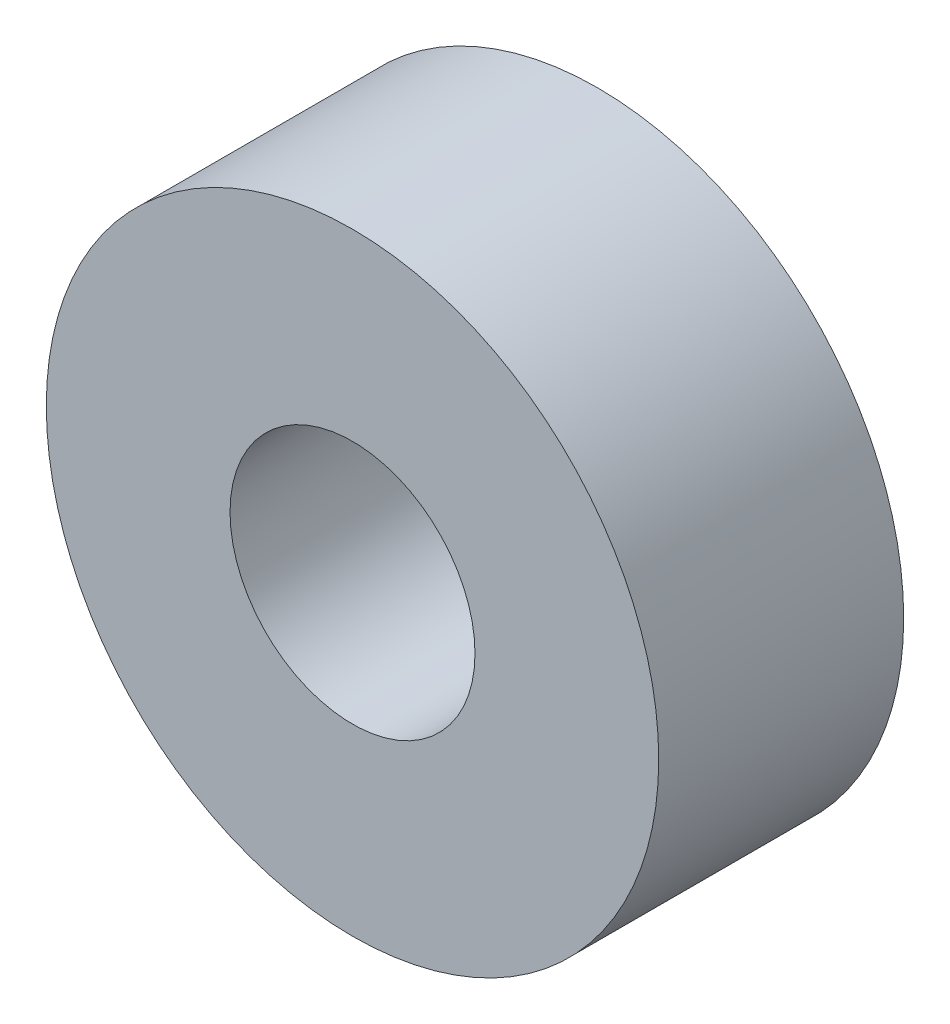
ISO-10303-21;
HEADER;
FILE_DESCRIPTION(('STEP AP214'),'2;1');
FILE_NAME('part.step','',(''),(''),'','','');
FILE_SCHEMA(('AUTOMOTIVE_DESIGN { 1 0 10303 214 1 1 1 1 }'));
ENDSEC;
DATA;
#1=APPLICATION_CONTEXT('core data for automotive mechanical design processes');
#2=APPLICATION_PROTOCOL_DEFINITION('international standard','automotive_design',2000,#1);
#3=PRODUCT_CONTEXT('',#1,'mechanical');
#4=PRODUCT('Part','Part','',(#3));
#5=PRODUCT_RELATED_PRODUCT_CATEGORY('part','',(#4));
#6=PRODUCT_DEFINITION_FORMATION('','',#4);
#7=PRODUCT_DEFINITION_CONTEXT('part definition',#1,'design');
#8=PRODUCT_DEFINITION('design','',#6,#7);
#9=PRODUCT_DEFINITION_SHAPE('','',#8);
#10=(LENGTH_UNIT() NAMED_UNIT(*) SI_UNIT(.MILLI.,.METRE.));
#11=(NAMED_UNIT(*) PLANE_ANGLE_UNIT() SI_UNIT($,.RADIAN.));
#12=(NAMED_UNIT(*) SI_UNIT($,.STERADIAN.) SOLID_ANGLE_UNIT());
#13=UNCERTAINTY_MEASURE_WITH_UNIT(LENGTH_MEASURE(1.E-05),#10,'distance_accuracy_value','');
#14=(GEOMETRIC_REPRESENTATION_CONTEXT(3) GLOBAL_UNCERTAINTY_ASSIGNED_CONTEXT((#13)) GLOBAL_UNIT_ASSIGNED_CONTEXT((#10,
#11,#12)) REPRESENTATION_CONTEXT('',''));
#15=CARTESIAN_POINT('',(0.,0.,0.));
#16=DIRECTION('',(0.,0.,1.));
#17=DIRECTION('',(1.,0.,0.));
#18=AXIS2_PLACEMENT_3D('',#15,#16,#17);
#19=CARTESIAN_POINT('',(0.,0.,4.));
#20=DIRECTION('',(0.,0.,1.));
#21=DIRECTION('',(1.,0.,0.));
#22=AXIS2_PLACEMENT_3D('',#19,#20,#21);
#23=PLANE('',#22);
#24=CARTESIAN_POINT('',(0.,0.,4.));
#25=DIRECTION('',(0.,0.,1.));
#26=DIRECTION('',(1.,0.,0.));
#27=AXIS2_PLACEMENT_3D('',#24,#25,#26);
#28=CIRCLE('',#27,5.);
#29=CARTESIAN_POINT('',(5.,0.,4.));
#30=VERTEX_POINT('',#29);
#31=EDGE_CURVE('E10',#30,#30,#28,.T.);
#32=ORIENTED_EDGE('',*,*,#31,.T.);
#33=EDGE_LOOP('',(#32));
#34=FACE_BOUND('',#33,.T.);
#35=CARTESIAN_POINT('',(0.,0.,4.));
#36=DIRECTION('',(0.,0.,1.));
#37=DIRECTION('',(1.,0.,0.));
#38=AXIS2_PLACEMENT_3D('',#35,#36,#37);
#39=CIRCLE('',#38,2.);
#40=CARTESIAN_POINT('',(2.,0.,4.));
#41=VERTEX_POINT('',#40);
#42=EDGE_CURVE('E41',#41,#41,#39,.T.);
#43=ORIENTED_EDGE('',*,*,#42,.F.);
#44=EDGE_LOOP('',(#43));
#45=FACE_BOUND('',#44,.T.);
#46=ADVANCED_FACE('F30',(#34,#45),#23,.T.);
#47=CARTESIAN_POINT('',(0.,0.,0.));
#48=DIRECTION('',(0.,0.,1.));
#49=DIRECTION('',(1.,0.,0.));
#50=AXIS2_PLACEMENT_3D('',#47,#48,#49);
#51=PLANE('',#50);
#52=CARTESIAN_POINT('',(0.,0.,0.));
#53=DIRECTION('',(0.,0.,1.));
#54=DIRECTION('',(1.,0.,0.));
#55=AXIS2_PLACEMENT_3D('',#52,#53,#54);
#56=CIRCLE('',#55,5.);
#57=CARTESIAN_POINT('',(5.,0.,0.));
#58=VERTEX_POINT('',#57);
#59=EDGE_CURVE('E34',#58,#58,#56,.T.);
#60=ORIENTED_EDGE('',*,*,#59,.F.);
#61=EDGE_LOOP('',(#60));
#62=FACE_BOUND('',#61,.T.);
#63=CARTESIAN_POINT('',(0.,0.,0.));
#64=DIRECTION('',(0.,0.,1.));
#65=DIRECTION('',(1.,0.,0.));
#66=AXIS2_PLACEMENT_3D('',#63,#64,#65);
#67=CIRCLE('',#66,2.);
#68=CARTESIAN_POINT('',(2.,0.,0.));
#69=VERTEX_POINT('',#68);
#70=EDGE_CURVE('E43',#69,#69,#67,.T.);
#71=ORIENTED_EDGE('',*,*,#70,.T.);
#72=EDGE_LOOP('',(#71));
#73=FACE_BOUND('',#72,.T.);
#74=ADVANCED_FACE('F53',(#62,#73),#51,.F.);
#75=CARTESIAN_POINT('',(0.,0.,4.));
#76=DIRECTION('',(0.,0.,-1.));
#77=DIRECTION('',(-1.,0.,0.));
#78=AXIS2_PLACEMENT_3D('',#75,#76,#77);
#79=CYLINDRICAL_SURFACE('',#78,5.);
#80=ORIENTED_EDGE('',*,*,#31,.F.);
#81=EDGE_LOOP('',(#80));
#82=FACE_BOUND('',#81,.T.);
#83=ORIENTED_EDGE('',*,*,#59,.T.);
#84=EDGE_LOOP('',(#83));
#85=FACE_BOUND('',#84,.T.);
#86=ADVANCED_FACE('F32',(#82,#85),#79,.T.);
#87=CARTESIAN_POINT('',(0.,0.,4.));
#88=DIRECTION('',(0.,0.,-1.));
#89=DIRECTION('',(-1.,0.,0.));
#90=AXIS2_PLACEMENT_3D('',#87,#88,#89);
#91=CYLINDRICAL_SURFACE('',#90,2.);
#92=ORIENTED_EDGE('',*,*,#42,.T.);
#93=EDGE_LOOP('',(#92));
#94=FACE_BOUND('',#93,.T.);
#95=ORIENTED_EDGE('',*,*,#70,.F.);
#96=EDGE_LOOP('',(#95));
#97=FACE_BOUND('',#96,.T.);
#98=ADVANCED_FACE('F49',(#94,#97),#91,.F.);
#99=CLOSED_SHELL('',(#46,#74,#86,#98));
#100=MANIFOLD_SOLID_BREP('B2',#99);
#101=ADVANCED_BREP_SHAPE_REPRESENTATION('',(#18,#100),#14);
#102=SHAPE_DEFINITION_REPRESENTATION(#9,#101);
ENDSEC;
END-ISO-10303-21;
